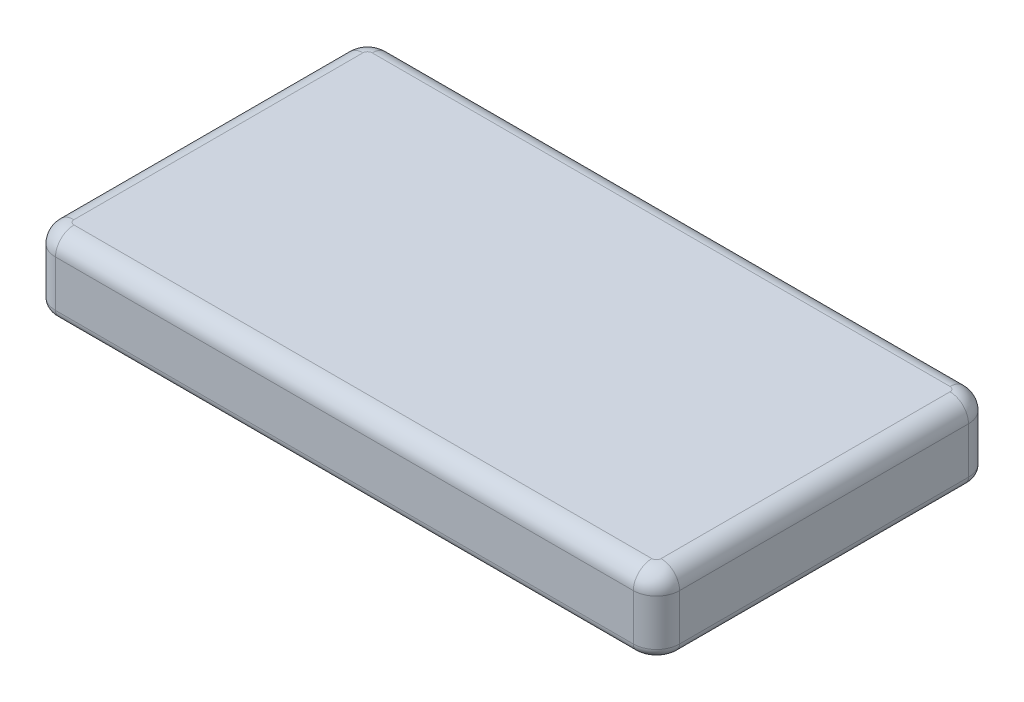
ISO-10303-21;
HEADER;
FILE_DESCRIPTION(('STEP AP214'),'2;1');
FILE_NAME('part.step','',(''),(''),'','','');
FILE_SCHEMA(('AUTOMOTIVE_DESIGN { 1 0 10303 214 1 1 1 1 }'));
ENDSEC;
DATA;
#1=APPLICATION_CONTEXT('core data for automotive mechanical design processes');
#2=APPLICATION_PROTOCOL_DEFINITION('international standard','automotive_design',2000,#1);
#3=PRODUCT_CONTEXT('',#1,'mechanical');
#4=PRODUCT('Part','Part','',(#3));
#5=PRODUCT_RELATED_PRODUCT_CATEGORY('part','',(#4));
#6=PRODUCT_DEFINITION_FORMATION('','',#4);
#7=PRODUCT_DEFINITION_CONTEXT('part definition',#1,'design');
#8=PRODUCT_DEFINITION('design','',#6,#7);
#9=PRODUCT_DEFINITION_SHAPE('','',#8);
#10=(LENGTH_UNIT() NAMED_UNIT(*) SI_UNIT(.MILLI.,.METRE.));
#11=(NAMED_UNIT(*) PLANE_ANGLE_UNIT() SI_UNIT($,.RADIAN.));
#12=(NAMED_UNIT(*) SI_UNIT($,.STERADIAN.) SOLID_ANGLE_UNIT());
#13=UNCERTAINTY_MEASURE_WITH_UNIT(LENGTH_MEASURE(1.E-05),#10,'distance_accuracy_value','');
#14=(GEOMETRIC_REPRESENTATION_CONTEXT(3) GLOBAL_UNCERTAINTY_ASSIGNED_CONTEXT((#13)) GLOBAL_UNIT_ASSIGNED_CONTEXT((#10,
#11,#12)) REPRESENTATION_CONTEXT('',''));
#15=CARTESIAN_POINT('',(0.,0.,0.));
#16=DIRECTION('',(0.,0.,1.));
#17=DIRECTION('',(1.,0.,0.));
#18=AXIS2_PLACEMENT_3D('',#15,#16,#17);
#19=CARTESIAN_POINT('',(135.,32.,72.5));
#20=DIRECTION('',(0.,1.,0.));
#21=DIRECTION('',(0.,0.,1.));
#22=AXIS2_PLACEMENT_3D('',#19,#20,#21);
#23=PLANE('',#22);
#24=CARTESIAN_POINT('',(125.,32.,62.5));
#25=DIRECTION('',(0.,1.,0.));
#26=DIRECTION('',(0.,0.,1.));
#27=AXIS2_PLACEMENT_3D('',#24,#25,#26);
#28=CIRCLE('',#27,2.);
#29=CARTESIAN_POINT('',(127.,32.,62.5));
#30=VERTEX_POINT('',#29);
#31=CARTESIAN_POINT('',(125.,32.,64.5));
#32=VERTEX_POINT('',#31);
#33=EDGE_CURVE('E259',#30,#32,#28,.F.);
#34=ORIENTED_EDGE('',*,*,#33,.F.);
#35=DIRECTION('',(0.,0.,-1.));
#36=VECTOR('',#35,1.);
#37=CARTESIAN_POINT('',(127.,32.,-72.5));
#38=LINE('',#37,#36);
#39=CARTESIAN_POINT('',(127.,32.,-62.5));
#40=VERTEX_POINT('',#39);
#41=EDGE_CURVE('E231',#30,#40,#38,.T.);
#42=ORIENTED_EDGE('',*,*,#41,.T.);
#43=CARTESIAN_POINT('',(125.,32.,-62.5));
#44=DIRECTION('',(0.,1.,0.));
#45=DIRECTION('',(0.,0.,1.));
#46=AXIS2_PLACEMENT_3D('',#43,#44,#45);
#47=CIRCLE('',#46,2.);
#48=CARTESIAN_POINT('',(125.,32.,-64.5));
#49=VERTEX_POINT('',#48);
#50=EDGE_CURVE('E256',#49,#40,#47,.F.);
#51=ORIENTED_EDGE('',*,*,#50,.F.);
#52=DIRECTION('',(-1.,0.,0.));
#53=VECTOR('',#52,1.);
#54=CARTESIAN_POINT('',(-135.,32.,-64.5));
#55=LINE('',#54,#53);
#56=CARTESIAN_POINT('',(-125.,32.,-64.5));
#57=VERTEX_POINT('',#56);
#58=EDGE_CURVE('E228',#49,#57,#55,.T.);
#59=ORIENTED_EDGE('',*,*,#58,.T.);
#60=CARTESIAN_POINT('',(-125.,32.,-62.5));
#61=DIRECTION('',(0.,1.,0.));
#62=DIRECTION('',(0.,0.,1.));
#63=AXIS2_PLACEMENT_3D('',#60,#61,#62);
#64=CIRCLE('',#63,2.);
#65=CARTESIAN_POINT('',(-127.,32.,-62.5));
#66=VERTEX_POINT('',#65);
#67=EDGE_CURVE('E251',#66,#57,#64,.F.);
#68=ORIENTED_EDGE('',*,*,#67,.F.);
#69=DIRECTION('',(0.,0.,1.));
#70=VECTOR('',#69,1.);
#71=CARTESIAN_POINT('',(-127.,32.,72.5));
#72=LINE('',#71,#70);
#73=CARTESIAN_POINT('',(-127.,32.,62.5));
#74=VERTEX_POINT('',#73);
#75=EDGE_CURVE('E224',#66,#74,#72,.T.);
#76=ORIENTED_EDGE('',*,*,#75,.T.);
#77=CARTESIAN_POINT('',(-125.,32.,62.5));
#78=DIRECTION('',(0.,1.,0.));
#79=DIRECTION('',(0.,0.,1.));
#80=AXIS2_PLACEMENT_3D('',#77,#78,#79);
#81=CIRCLE('',#80,2.);
#82=CARTESIAN_POINT('',(-125.,32.,64.5));
#83=VERTEX_POINT('',#82);
#84=EDGE_CURVE('E254',#83,#74,#81,.F.);
#85=ORIENTED_EDGE('',*,*,#84,.F.);
#86=DIRECTION('',(1.,0.,0.));
#87=VECTOR('',#86,1.);
#88=CARTESIAN_POINT('',(135.,32.,64.5));
#89=LINE('',#88,#87);
#90=EDGE_CURVE('E221',#83,#32,#89,.T.);
#91=ORIENTED_EDGE('',*,*,#90,.T.);
#92=EDGE_LOOP('',(#34,#42,#51,#59,#68,#76,#85,#91));
#93=FACE_BOUND('',#92,.T.);
#94=ADVANCED_FACE('F34',(#93),#23,.T.);
#95=CARTESIAN_POINT('',(135.,32.,-72.5));
#96=DIRECTION('',(-1.,0.,0.));
#97=DIRECTION('',(0.,0.,1.));
#98=AXIS2_PLACEMENT_3D('',#95,#96,#97);
#99=PLANE('',#98);
#100=DIRECTION('',(0.,-1.,0.));
#101=VECTOR('',#100,1.);
#102=CARTESIAN_POINT('',(135.,32.,62.5));
#103=LINE('',#102,#101);
#104=CARTESIAN_POINT('',(135.,24.,62.5));
#105=VERTEX_POINT('',#104);
#106=CARTESIAN_POINT('',(135.,4.,62.5));
#107=VERTEX_POINT('',#106);
#108=EDGE_CURVE('E288',#105,#107,#103,.T.);
#109=ORIENTED_EDGE('',*,*,#108,.T.);
#110=DIRECTION('',(0.,0.,-1.));
#111=VECTOR('',#110,1.);
#112=CARTESIAN_POINT('',(135.,4.,-72.5));
#113=LINE('',#112,#111);
#114=CARTESIAN_POINT('',(135.,4.,-62.5));
#115=VERTEX_POINT('',#114);
#116=EDGE_CURVE('E324',#107,#115,#113,.T.);
#117=ORIENTED_EDGE('',*,*,#116,.T.);
#118=DIRECTION('',(0.,-1.,0.));
#119=VECTOR('',#118,1.);
#120=CARTESIAN_POINT('',(135.,32.,-62.5));
#121=LINE('',#120,#119);
#122=CARTESIAN_POINT('',(135.,24.,-62.5));
#123=VERTEX_POINT('',#122);
#124=EDGE_CURVE('E291',#115,#123,#121,.F.);
#125=ORIENTED_EDGE('',*,*,#124,.T.);
#126=DIRECTION('',(0.,0.,-1.));
#127=VECTOR('',#126,1.);
#128=CARTESIAN_POINT('',(135.,24.,72.5));
#129=LINE('',#128,#127);
#130=EDGE_CURVE('E234',#123,#105,#129,.F.);
#131=ORIENTED_EDGE('',*,*,#130,.T.);
#132=EDGE_LOOP('',(#109,#117,#125,#131));
#133=FACE_BOUND('',#132,.T.);
#134=ADVANCED_FACE('F425',(#133),#99,.F.);
#135=CARTESIAN_POINT('',(-135.,32.,-72.5));
#136=DIRECTION('',(0.,0.,1.));
#137=DIRECTION('',(1.,0.,0.));
#138=AXIS2_PLACEMENT_3D('',#135,#136,#137);
#139=PLANE('',#138);
#140=DIRECTION('',(0.,-1.,0.));
#141=VECTOR('',#140,1.);
#142=CARTESIAN_POINT('',(125.,32.,-72.5));
#143=LINE('',#142,#141);
#144=CARTESIAN_POINT('',(125.,24.,-72.5));
#145=VERTEX_POINT('',#144);
#146=CARTESIAN_POINT('',(125.,4.,-72.5));
#147=VERTEX_POINT('',#146);
#148=EDGE_CURVE('E279',#145,#147,#143,.T.);
#149=ORIENTED_EDGE('',*,*,#148,.T.);
#150=DIRECTION('',(-1.,0.,0.));
#151=VECTOR('',#150,1.);
#152=CARTESIAN_POINT('',(-135.,4.,-72.5));
#153=LINE('',#152,#151);
#154=CARTESIAN_POINT('',(-125.,4.,-72.5));
#155=VERTEX_POINT('',#154);
#156=EDGE_CURVE('E11',#147,#155,#153,.T.);
#157=ORIENTED_EDGE('',*,*,#156,.T.);
#158=DIRECTION('',(0.,-1.,0.));
#159=VECTOR('',#158,1.);
#160=CARTESIAN_POINT('',(-125.,32.,-72.5));
#161=LINE('',#160,#159);
#162=CARTESIAN_POINT('',(-125.,24.,-72.5));
#163=VERTEX_POINT('',#162);
#164=EDGE_CURVE('E281',#155,#163,#161,.F.);
#165=ORIENTED_EDGE('',*,*,#164,.T.);
#166=DIRECTION('',(-1.,0.,0.));
#167=VECTOR('',#166,1.);
#168=CARTESIAN_POINT('',(135.,24.,-72.5));
#169=LINE('',#168,#167);
#170=EDGE_CURVE('E237',#163,#145,#169,.F.);
#171=ORIENTED_EDGE('',*,*,#170,.T.);
#172=EDGE_LOOP('',(#149,#157,#165,#171));
#173=FACE_BOUND('',#172,.T.);
#174=ADVANCED_FACE('F430',(#173),#139,.F.);
#175=CARTESIAN_POINT('',(-135.,32.,-72.5));
#176=DIRECTION('',(1.,0.,0.));
#177=DIRECTION('',(0.,0.,-1.));
#178=AXIS2_PLACEMENT_3D('',#175,#176,#177);
#179=PLANE('',#178);
#180=CARTESIAN_POINT('',(-135.,14.,48.2202590226989));
#181=DIRECTION('',(-1.,0.,0.));
#182=DIRECTION('',(0.,0.,1.));
#183=AXIS2_PLACEMENT_3D('',#180,#181,#182);
#184=CIRCLE('',#183,4.70742148390949);
#185=CARTESIAN_POINT('',(-135.,14.,52.9276805066084));
#186=VERTEX_POINT('',#185);
#187=EDGE_CURVE('E198',#186,#186,#184,.T.);
#188=ORIENTED_EDGE('',*,*,#187,.F.);
#189=EDGE_LOOP('',(#188));
#190=FACE_BOUND('',#189,.T.);
#191=DIRECTION('',(0.,0.,-1.));
#192=VECTOR('',#191,1.);
#193=CARTESIAN_POINT('',(-135.,18.040115952738,-11.5768889094162));
#194=LINE('',#193,#192);
#195=CARTESIAN_POINT('',(-135.,18.040115952738,11.5768889094163));
#196=VERTEX_POINT('',#195);
#197=CARTESIAN_POINT('',(-135.,18.040115952738,-11.5768889094162));
#198=VERTEX_POINT('',#197);
#199=EDGE_CURVE('E204',#196,#198,#194,.T.);
#200=ORIENTED_EDGE('',*,*,#199,.F.);
#201=DIRECTION('',(0.,1.,0.));
#202=VECTOR('',#201,1.);
#203=CARTESIAN_POINT('',(-135.,18.040115952738,11.5768889094163));
#204=LINE('',#203,#202);
#205=CARTESIAN_POINT('',(-135.,9.95988404726204,11.5768889094163));
#206=VERTEX_POINT('',#205);
#207=EDGE_CURVE('E51',#206,#196,#204,.T.);
#208=ORIENTED_EDGE('',*,*,#207,.F.);
#209=DIRECTION('',(0.,0.,1.));
#210=VECTOR('',#209,1.);
#211=CARTESIAN_POINT('',(-135.,9.95988404726204,-11.5768889094162));
#212=LINE('',#211,#210);
#213=CARTESIAN_POINT('',(-135.,9.95988404726204,-11.5768889094162));
#214=VERTEX_POINT('',#213);
#215=EDGE_CURVE('E192',#214,#206,#212,.T.);
#216=ORIENTED_EDGE('',*,*,#215,.F.);
#217=DIRECTION('',(0.,-1.,0.));
#218=VECTOR('',#217,1.);
#219=CARTESIAN_POINT('',(-135.,18.040115952738,-11.5768889094162));
#220=LINE('',#219,#218);
#221=EDGE_CURVE('E195',#198,#214,#220,.T.);
#222=ORIENTED_EDGE('',*,*,#221,.F.);
#223=EDGE_LOOP('',(#200,#208,#216,#222));
#224=FACE_BOUND('',#223,.T.);
#225=CARTESIAN_POINT('',(-135.,14.,-45.2002010463294));
#226=DIRECTION('',(-1.,0.,0.));
#227=DIRECTION('',(0.,0.,1.));
#228=AXIS2_PLACEMENT_3D('',#225,#226,#227);
#229=CIRCLE('',#228,3.52196255597082);
#230=CARTESIAN_POINT('',(-135.,14.,-41.6782384903585));
#231=VERTEX_POINT('',#230);
#232=EDGE_CURVE('E211',#231,#231,#229,.T.);
#233=ORIENTED_EDGE('',*,*,#232,.F.);
#234=EDGE_LOOP('',(#233));
#235=FACE_BOUND('',#234,.T.);
#236=DIRECTION('',(0.,-1.,0.));
#237=VECTOR('',#236,1.);
#238=CARTESIAN_POINT('',(-135.,32.,-62.5));
#239=LINE('',#238,#237);
#240=CARTESIAN_POINT('',(-135.,24.,-62.5));
#241=VERTEX_POINT('',#240);
#242=CARTESIAN_POINT('',(-135.,4.,-62.5));
#243=VERTEX_POINT('',#242);
#244=EDGE_CURVE('E276',#241,#243,#239,.T.);
#245=ORIENTED_EDGE('',*,*,#244,.T.);
#246=DIRECTION('',(0.,0.,1.));
#247=VECTOR('',#246,1.);
#248=CARTESIAN_POINT('',(-135.,4.,-72.5));
#249=LINE('',#248,#247);
#250=CARTESIAN_POINT('',(-135.,4.,62.5));
#251=VERTEX_POINT('',#250);
#252=EDGE_CURVE('E332',#243,#251,#249,.T.);
#253=ORIENTED_EDGE('',*,*,#252,.T.);
#254=DIRECTION('',(0.,-1.,0.));
#255=VECTOR('',#254,1.);
#256=CARTESIAN_POINT('',(-135.,32.,62.5));
#257=LINE('',#256,#255);
#258=CARTESIAN_POINT('',(-135.,24.,62.5));
#259=VERTEX_POINT('',#258);
#260=EDGE_CURVE('E274',#251,#259,#257,.F.);
#261=ORIENTED_EDGE('',*,*,#260,.T.);
#262=DIRECTION('',(0.,0.,1.));
#263=VECTOR('',#262,1.);
#264=CARTESIAN_POINT('',(-135.,24.,-72.5));
#265=LINE('',#264,#263);
#266=EDGE_CURVE('E240',#259,#241,#265,.F.);
#267=ORIENTED_EDGE('',*,*,#266,.T.);
#268=EDGE_LOOP('',(#245,#253,#261,#267));
#269=FACE_BOUND('',#268,.T.);
#270=ADVANCED_FACE('F443',(#190,#224,#235,#269),#179,.F.);
#271=CARTESIAN_POINT('',(-135.,32.,72.5));
#272=DIRECTION('',(0.,0.,-1.));
#273=DIRECTION('',(-1.,0.,0.));
#274=AXIS2_PLACEMENT_3D('',#271,#272,#273);
#275=PLANE('',#274);
#276=DIRECTION('',(0.,-1.,0.));
#277=VECTOR('',#276,1.);
#278=CARTESIAN_POINT('',(-125.,32.,72.5));
#279=LINE('',#278,#277);
#280=CARTESIAN_POINT('',(-125.,24.,72.5));
#281=VERTEX_POINT('',#280);
#282=CARTESIAN_POINT('',(-125.,4.,72.5));
#283=VERTEX_POINT('',#282);
#284=EDGE_CURVE('E285',#281,#283,#279,.T.);
#285=ORIENTED_EDGE('',*,*,#284,.T.);
#286=DIRECTION('',(1.,0.,0.));
#287=VECTOR('',#286,1.);
#288=CARTESIAN_POINT('',(-135.,4.,72.5));
#289=LINE('',#288,#287);
#290=CARTESIAN_POINT('',(125.,4.,72.5));
#291=VERTEX_POINT('',#290);
#292=EDGE_CURVE('E328',#283,#291,#289,.T.);
#293=ORIENTED_EDGE('',*,*,#292,.T.);
#294=DIRECTION('',(0.,-1.,0.));
#295=VECTOR('',#294,1.);
#296=CARTESIAN_POINT('',(125.,32.,72.5));
#297=LINE('',#296,#295);
#298=CARTESIAN_POINT('',(125.,24.,72.5));
#299=VERTEX_POINT('',#298);
#300=EDGE_CURVE('E283',#291,#299,#297,.F.);
#301=ORIENTED_EDGE('',*,*,#300,.T.);
#302=DIRECTION('',(1.,0.,0.));
#303=VECTOR('',#302,1.);
#304=CARTESIAN_POINT('',(-135.,24.,72.5));
#305=LINE('',#304,#303);
#306=EDGE_CURVE('E243',#299,#281,#305,.F.);
#307=ORIENTED_EDGE('',*,*,#306,.T.);
#308=EDGE_LOOP('',(#285,#293,#301,#307));
#309=FACE_BOUND('',#308,.T.);
#310=ADVANCED_FACE('F371',(#309),#275,.F.);
#311=CARTESIAN_POINT('',(135.,0.,72.5));
#312=DIRECTION('',(0.,1.,0.));
#313=DIRECTION('',(0.,0.,1.));
#314=AXIS2_PLACEMENT_3D('',#311,#312,#313);
#315=PLANE('',#314);
#316=DIRECTION('',(-1.,0.,0.));
#317=VECTOR('',#316,1.);
#318=CARTESIAN_POINT('',(135.,0.,-68.5));
#319=LINE('',#318,#317);
#320=CARTESIAN_POINT('',(-125.,0.,-68.5));
#321=VERTEX_POINT('',#320);
#322=CARTESIAN_POINT('',(125.,0.,-68.5));
#323=VERTEX_POINT('',#322);
#324=EDGE_CURVE('E293',#321,#323,#319,.F.);
#325=ORIENTED_EDGE('',*,*,#324,.T.);
#326=CARTESIAN_POINT('',(125.,0.,-62.5));
#327=DIRECTION('',(0.,1.,0.));
#328=DIRECTION('',(0.,0.,1.));
#329=AXIS2_PLACEMENT_3D('',#326,#327,#328);
#330=CIRCLE('',#329,6.);
#331=CARTESIAN_POINT('',(131.,0.,-62.5));
#332=VERTEX_POINT('',#331);
#333=EDGE_CURVE('E318',#323,#332,#330,.F.);
#334=ORIENTED_EDGE('',*,*,#333,.T.);
#335=DIRECTION('',(0.,0.,-1.));
#336=VECTOR('',#335,1.);
#337=CARTESIAN_POINT('',(131.,0.,72.5));
#338=LINE('',#337,#336);
#339=CARTESIAN_POINT('',(131.,0.,62.5));
#340=VERTEX_POINT('',#339);
#341=EDGE_CURVE('E316',#332,#340,#338,.F.);
#342=ORIENTED_EDGE('',*,*,#341,.T.);
#343=CARTESIAN_POINT('',(125.,0.,62.5));
#344=DIRECTION('',(0.,1.,0.));
#345=DIRECTION('',(0.,0.,1.));
#346=AXIS2_PLACEMENT_3D('',#343,#344,#345);
#347=CIRCLE('',#346,6.);
#348=CARTESIAN_POINT('',(125.,0.,68.5));
#349=VERTEX_POINT('',#348);
#350=EDGE_CURVE('E314',#340,#349,#347,.F.);
#351=ORIENTED_EDGE('',*,*,#350,.T.);
#352=DIRECTION('',(1.,0.,0.));
#353=VECTOR('',#352,1.);
#354=CARTESIAN_POINT('',(135.,0.,68.5));
#355=LINE('',#354,#353);
#356=CARTESIAN_POINT('',(-125.,0.,68.5));
#357=VERTEX_POINT('',#356);
#358=EDGE_CURVE('E312',#349,#357,#355,.F.);
#359=ORIENTED_EDGE('',*,*,#358,.T.);
#360=CARTESIAN_POINT('',(-125.,0.,62.5));
#361=DIRECTION('',(0.,1.,0.));
#362=DIRECTION('',(0.,0.,1.));
#363=AXIS2_PLACEMENT_3D('',#360,#361,#362);
#364=CIRCLE('',#363,6.);
#365=CARTESIAN_POINT('',(-131.,0.,62.5));
#366=VERTEX_POINT('',#365);
#367=EDGE_CURVE('E310',#357,#366,#364,.F.);
#368=ORIENTED_EDGE('',*,*,#367,.T.);
#369=DIRECTION('',(0.,0.,1.));
#370=VECTOR('',#369,1.);
#371=CARTESIAN_POINT('',(-131.,0.,72.5000000000001));
#372=LINE('',#371,#370);
#373=CARTESIAN_POINT('',(-131.,0.,-62.5));
#374=VERTEX_POINT('',#373);
#375=EDGE_CURVE('E308',#366,#374,#372,.F.);
#376=ORIENTED_EDGE('',*,*,#375,.T.);
#377=CARTESIAN_POINT('',(-125.,0.,-62.5));
#378=DIRECTION('',(0.,1.,0.));
#379=DIRECTION('',(0.,0.,1.));
#380=AXIS2_PLACEMENT_3D('',#377,#378,#379);
#381=CIRCLE('',#380,6.);
#382=EDGE_CURVE('E306',#374,#321,#381,.F.);
#383=ORIENTED_EDGE('',*,*,#382,.T.);
#384=EDGE_LOOP('',(#325,#334,#342,#351,#359,#368,#376,#383));
#385=FACE_BOUND('',#384,.T.);
#386=ADVANCED_FACE('F437',(#385),#315,.F.);
#387=CARTESIAN_POINT('',(-127.,24.,72.5000000000001));
#388=DIRECTION('',(0.,0.,-1.));
#389=DIRECTION('',(-1.,0.,0.));
#390=AXIS2_PLACEMENT_3D('',#387,#388,#389);
#391=CYLINDRICAL_SURFACE('',#390,8.);
#392=ORIENTED_EDGE('',*,*,#266,.F.);
#393=CARTESIAN_POINT('',(-127.,24.,62.5));
#394=DIRECTION('',(0.,0.,-1.));
#395=DIRECTION('',(-1.,0.,0.));
#396=AXIS2_PLACEMENT_3D('',#393,#394,#395);
#397=CIRCLE('',#396,8.);
#398=EDGE_CURVE('E267',#259,#74,#397,.T.);
#399=ORIENTED_EDGE('',*,*,#398,.T.);
#400=ORIENTED_EDGE('',*,*,#75,.F.);
#401=CARTESIAN_POINT('',(-127.,24.,-62.5));
#402=DIRECTION('',(0.,0.,1.));
#403=DIRECTION('',(1.,0.,0.));
#404=AXIS2_PLACEMENT_3D('',#401,#402,#403);
#405=CIRCLE('',#404,8.);
#406=EDGE_CURVE('E265',#66,#241,#405,.T.);
#407=ORIENTED_EDGE('',*,*,#406,.T.);
#408=EDGE_LOOP('',(#392,#399,#400,#407));
#409=FACE_BOUND('',#408,.T.);
#410=ADVANCED_FACE('F409',(#409),#391,.T.);
#411=CARTESIAN_POINT('',(135.,24.,64.5));
#412=DIRECTION('',(-1.,0.,0.));
#413=DIRECTION('',(0.,0.,1.));
#414=AXIS2_PLACEMENT_3D('',#411,#412,#413);
#415=CYLINDRICAL_SURFACE('',#414,8.);
#416=ORIENTED_EDGE('',*,*,#306,.F.);
#417=CARTESIAN_POINT('',(125.,24.,64.5));
#418=DIRECTION('',(-1.,0.,0.));
#419=DIRECTION('',(0.,0.,1.));
#420=AXIS2_PLACEMENT_3D('',#417,#418,#419);
#421=CIRCLE('',#420,8.);
#422=EDGE_CURVE('E248',#299,#32,#421,.T.);
#423=ORIENTED_EDGE('',*,*,#422,.T.);
#424=ORIENTED_EDGE('',*,*,#90,.F.);
#425=CARTESIAN_POINT('',(-125.,24.,64.5));
#426=DIRECTION('',(1.,0.,0.));
#427=DIRECTION('',(0.,0.,-1.));
#428=AXIS2_PLACEMENT_3D('',#425,#426,#427);
#429=CIRCLE('',#428,8.);
#430=EDGE_CURVE('E246',#83,#281,#429,.T.);
#431=ORIENTED_EDGE('',*,*,#430,.T.);
#432=EDGE_LOOP('',(#416,#423,#424,#431));
#433=FACE_BOUND('',#432,.T.);
#434=ADVANCED_FACE('F376',(#433),#415,.T.);
#435=CARTESIAN_POINT('',(135.,24.,-64.5));
#436=DIRECTION('',(1.,0.,0.));
#437=DIRECTION('',(0.,0.,-1.));
#438=AXIS2_PLACEMENT_3D('',#435,#436,#437);
#439=CYLINDRICAL_SURFACE('',#438,8.);
#440=ORIENTED_EDGE('',*,*,#170,.F.);
#441=CARTESIAN_POINT('',(-125.,24.,-64.5));
#442=DIRECTION('',(1.,0.,0.));
#443=DIRECTION('',(0.,0.,-1.));
#444=AXIS2_PLACEMENT_3D('',#441,#442,#443);
#445=CIRCLE('',#444,8.);
#446=EDGE_CURVE('E272',#163,#57,#445,.T.);
#447=ORIENTED_EDGE('',*,*,#446,.T.);
#448=ORIENTED_EDGE('',*,*,#58,.F.);
#449=CARTESIAN_POINT('',(125.,24.,-64.5));
#450=DIRECTION('',(-1.,0.,0.));
#451=DIRECTION('',(0.,0.,1.));
#452=AXIS2_PLACEMENT_3D('',#449,#450,#451);
#453=CIRCLE('',#452,8.);
#454=EDGE_CURVE('E270',#49,#145,#453,.T.);
#455=ORIENTED_EDGE('',*,*,#454,.T.);
#456=EDGE_LOOP('',(#440,#447,#448,#455));
#457=FACE_BOUND('',#456,.T.);
#458=ADVANCED_FACE('F401',(#457),#439,.T.);
#459=CARTESIAN_POINT('',(127.,24.,72.5));
#460=DIRECTION('',(0.,0.,1.));
#461=DIRECTION('',(1.,0.,0.));
#462=AXIS2_PLACEMENT_3D('',#459,#460,#461);
#463=CYLINDRICAL_SURFACE('',#462,8.);
#464=ORIENTED_EDGE('',*,*,#130,.F.);
#465=CARTESIAN_POINT('',(127.,24.,-62.5));
#466=DIRECTION('',(0.,0.,1.));
#467=DIRECTION('',(1.,0.,0.));
#468=AXIS2_PLACEMENT_3D('',#465,#466,#467);
#469=CIRCLE('',#468,8.);
#470=EDGE_CURVE('E263',#123,#40,#469,.T.);
#471=ORIENTED_EDGE('',*,*,#470,.T.);
#472=ORIENTED_EDGE('',*,*,#41,.F.);
#473=CARTESIAN_POINT('',(127.,24.,62.5));
#474=DIRECTION('',(0.,0.,-1.));
#475=DIRECTION('',(-1.,0.,0.));
#476=AXIS2_PLACEMENT_3D('',#473,#474,#475);
#477=CIRCLE('',#476,8.);
#478=EDGE_CURVE('E261',#30,#105,#477,.T.);
#479=ORIENTED_EDGE('',*,*,#478,.T.);
#480=EDGE_LOOP('',(#464,#471,#472,#479));
#481=FACE_BOUND('',#480,.T.);
#482=ADVANCED_FACE('F392',(#481),#463,.T.);
#483=CARTESIAN_POINT('',(125.,32.,62.5));
#484=DIRECTION('',(0.,-1.,0.));
#485=DIRECTION('',(0.,0.,-1.));
#486=AXIS2_PLACEMENT_3D('',#483,#484,#485);
#487=CYLINDRICAL_SURFACE('',#486,10.);
#488=ORIENTED_EDGE('',*,*,#300,.F.);
#489=CARTESIAN_POINT('',(125.,4.,62.5));
#490=DIRECTION('',(0.,1.,0.));
#491=DIRECTION('',(0.,0.,1.));
#492=AXIS2_PLACEMENT_3D('',#489,#490,#491);
#493=CIRCLE('',#492,10.);
#494=EDGE_CURVE('E326',#291,#107,#493,.T.);
#495=ORIENTED_EDGE('',*,*,#494,.T.);
#496=ORIENTED_EDGE('',*,*,#108,.F.);
#497=CARTESIAN_POINT('',(125.,24.,62.5));
#498=DIRECTION('',(0.,1.,0.));
#499=DIRECTION('',(0.,0.,1.));
#500=AXIS2_PLACEMENT_3D('',#497,#498,#499);
#501=CIRCLE('',#500,10.);
#502=EDGE_CURVE('E225',#299,#105,#501,.T.);
#503=ORIENTED_EDGE('',*,*,#502,.F.);
#504=EDGE_LOOP('',(#488,#495,#496,#503));
#505=FACE_BOUND('',#504,.T.);
#506=ADVANCED_FACE('F382',(#505),#487,.T.);
#507=CARTESIAN_POINT('',(125.,24.,62.5));
#508=DIRECTION('',(0.,1.,0.));
#509=DIRECTION('',(0.,0.,1.));
#510=AXIS2_PLACEMENT_3D('',#507,#508,#509);
#511=DEGENERATE_TOROIDAL_SURFACE('',#510,2.,8.,.T.);
#512=ORIENTED_EDGE('',*,*,#422,.F.);
#513=ORIENTED_EDGE('',*,*,#502,.T.);
#514=ORIENTED_EDGE('',*,*,#478,.F.);
#515=ORIENTED_EDGE('',*,*,#33,.T.);
#516=EDGE_LOOP('',(#512,#513,#514,#515));
#517=FACE_BOUND('',#516,.T.);
#518=ADVANCED_FACE('F386',(#517),#511,.T.);
#519=CARTESIAN_POINT('',(125.,32.,-62.5));
#520=DIRECTION('',(0.,-1.,0.));
#521=DIRECTION('',(0.,0.,-1.));
#522=AXIS2_PLACEMENT_3D('',#519,#520,#521);
#523=CYLINDRICAL_SURFACE('',#522,10.);
#524=ORIENTED_EDGE('',*,*,#124,.F.);
#525=CARTESIAN_POINT('',(125.,4.,-62.5));
#526=DIRECTION('',(0.,1.,0.));
#527=DIRECTION('',(0.,0.,1.));
#528=AXIS2_PLACEMENT_3D('',#525,#526,#527);
#529=CIRCLE('',#528,10.);
#530=EDGE_CURVE('E321',#115,#147,#529,.T.);
#531=ORIENTED_EDGE('',*,*,#530,.T.);
#532=ORIENTED_EDGE('',*,*,#148,.F.);
#533=CARTESIAN_POINT('',(125.,24.,-62.5));
#534=DIRECTION('',(0.,1.,0.));
#535=DIRECTION('',(0.,0.,1.));
#536=AXIS2_PLACEMENT_3D('',#533,#534,#535);
#537=CIRCLE('',#536,10.);
#538=EDGE_CURVE('E296',#123,#145,#537,.T.);
#539=ORIENTED_EDGE('',*,*,#538,.F.);
#540=EDGE_LOOP('',(#524,#531,#532,#539));
#541=FACE_BOUND('',#540,.T.);
#542=ADVANCED_FACE('F459',(#541),#523,.T.);
#543=CARTESIAN_POINT('',(125.,24.,-62.5));
#544=DIRECTION('',(0.,1.,0.));
#545=DIRECTION('',(0.,0.,1.));
#546=AXIS2_PLACEMENT_3D('',#543,#544,#545);
#547=DEGENERATE_TOROIDAL_SURFACE('',#546,2.,8.,.T.);
#548=ORIENTED_EDGE('',*,*,#454,.F.);
#549=ORIENTED_EDGE('',*,*,#50,.T.);
#550=ORIENTED_EDGE('',*,*,#470,.F.);
#551=ORIENTED_EDGE('',*,*,#538,.T.);
#552=EDGE_LOOP('',(#548,#549,#550,#551));
#553=FACE_BOUND('',#552,.T.);
#554=ADVANCED_FACE('F396',(#553),#547,.T.);
#555=CARTESIAN_POINT('',(-125.,32.,62.5));
#556=DIRECTION('',(0.,-1.,0.));
#557=DIRECTION('',(0.,0.,-1.));
#558=AXIS2_PLACEMENT_3D('',#555,#556,#557);
#559=CYLINDRICAL_SURFACE('',#558,10.);
#560=ORIENTED_EDGE('',*,*,#260,.F.);
#561=CARTESIAN_POINT('',(-125.,4.,62.5));
#562=DIRECTION('',(0.,1.,0.));
#563=DIRECTION('',(0.,0.,1.));
#564=AXIS2_PLACEMENT_3D('',#561,#562,#563);
#565=CIRCLE('',#564,10.);
#566=EDGE_CURVE('E330',#251,#283,#565,.T.);
#567=ORIENTED_EDGE('',*,*,#566,.T.);
#568=ORIENTED_EDGE('',*,*,#284,.F.);
#569=CARTESIAN_POINT('',(-125.,24.,62.5));
#570=DIRECTION('',(0.,1.,0.));
#571=DIRECTION('',(0.,0.,1.));
#572=AXIS2_PLACEMENT_3D('',#569,#570,#571);
#573=CIRCLE('',#572,10.);
#574=EDGE_CURVE('E299',#259,#281,#573,.T.);
#575=ORIENTED_EDGE('',*,*,#574,.F.);
#576=EDGE_LOOP('',(#560,#567,#568,#575));
#577=FACE_BOUND('',#576,.T.);
#578=ADVANCED_FACE('F368',(#577),#559,.T.);
#579=CARTESIAN_POINT('',(-125.,24.,62.5));
#580=DIRECTION('',(0.,1.,0.));
#581=DIRECTION('',(0.,0.,1.));
#582=AXIS2_PLACEMENT_3D('',#579,#580,#581);
#583=DEGENERATE_TOROIDAL_SURFACE('',#582,2.,8.,.T.);
#584=ORIENTED_EDGE('',*,*,#398,.F.);
#585=ORIENTED_EDGE('',*,*,#574,.T.);
#586=ORIENTED_EDGE('',*,*,#430,.F.);
#587=ORIENTED_EDGE('',*,*,#84,.T.);
#588=EDGE_LOOP('',(#584,#585,#586,#587));
#589=FACE_BOUND('',#588,.T.);
#590=ADVANCED_FACE('F412',(#589),#583,.T.);
#591=CARTESIAN_POINT('',(-125.,32.,-62.5));
#592=DIRECTION('',(0.,-1.,0.));
#593=DIRECTION('',(0.,0.,-1.));
#594=AXIS2_PLACEMENT_3D('',#591,#592,#593);
#595=CYLINDRICAL_SURFACE('',#594,10.);
#596=ORIENTED_EDGE('',*,*,#164,.F.);
#597=CARTESIAN_POINT('',(-125.,4.,-62.5));
#598=DIRECTION('',(0.,1.,0.));
#599=DIRECTION('',(0.,0.,1.));
#600=AXIS2_PLACEMENT_3D('',#597,#598,#599);
#601=CIRCLE('',#600,10.);
#602=EDGE_CURVE('E43',#155,#243,#601,.T.);
#603=ORIENTED_EDGE('',*,*,#602,.T.);
#604=ORIENTED_EDGE('',*,*,#244,.F.);
#605=CARTESIAN_POINT('',(-125.,24.,-62.5));
#606=DIRECTION('',(0.,1.,0.));
#607=DIRECTION('',(0.,0.,1.));
#608=AXIS2_PLACEMENT_3D('',#605,#606,#607);
#609=CIRCLE('',#608,10.);
#610=EDGE_CURVE('E302',#163,#241,#609,.T.);
#611=ORIENTED_EDGE('',*,*,#610,.F.);
#612=EDGE_LOOP('',(#596,#603,#604,#611));
#613=FACE_BOUND('',#612,.T.);
#614=ADVANCED_FACE('F414',(#613),#595,.T.);
#615=CARTESIAN_POINT('',(-125.,24.,-62.5));
#616=DIRECTION('',(0.,1.,0.));
#617=DIRECTION('',(0.,0.,1.));
#618=AXIS2_PLACEMENT_3D('',#615,#616,#617);
#619=DEGENERATE_TOROIDAL_SURFACE('',#618,2.,8.,.T.);
#620=ORIENTED_EDGE('',*,*,#406,.F.);
#621=ORIENTED_EDGE('',*,*,#67,.T.);
#622=ORIENTED_EDGE('',*,*,#446,.F.);
#623=ORIENTED_EDGE('',*,*,#610,.T.);
#624=EDGE_LOOP('',(#620,#621,#622,#623));
#625=FACE_BOUND('',#624,.T.);
#626=ADVANCED_FACE('F405',(#625),#619,.T.);
#627=CARTESIAN_POINT('',(-125.,4.,62.5));
#628=DIRECTION('',(0.,1.,0.));
#629=DIRECTION('',(0.,0.,1.));
#630=AXIS2_PLACEMENT_3D('',#627,#628,#629);
#631=TOROIDAL_SURFACE('',#630,6.,4.);
#632=CARTESIAN_POINT('',(-125.,4.,68.5));
#633=DIRECTION('',(1.,0.,0.));
#634=DIRECTION('',(0.,0.,-1.));
#635=AXIS2_PLACEMENT_3D('',#632,#633,#634);
#636=CIRCLE('',#635,4.);
#637=EDGE_CURVE('E349',#283,#357,#636,.T.);
#638=ORIENTED_EDGE('',*,*,#637,.F.);
#639=ORIENTED_EDGE('',*,*,#566,.F.);
#640=CARTESIAN_POINT('',(-131.,4.,62.5));
#641=DIRECTION('',(0.,0.,-1.));
#642=DIRECTION('',(-1.,0.,0.));
#643=AXIS2_PLACEMENT_3D('',#640,#641,#642);
#644=CIRCLE('',#643,4.);
#645=EDGE_CURVE('E38',#366,#251,#644,.T.);
#646=ORIENTED_EDGE('',*,*,#645,.F.);
#647=ORIENTED_EDGE('',*,*,#367,.F.);
#648=EDGE_LOOP('',(#638,#639,#646,#647));
#649=FACE_BOUND('',#648,.T.);
#650=ADVANCED_FACE('F36',(#649),#631,.T.);
#651=CARTESIAN_POINT('',(-131.,4.,-72.5));
#652=DIRECTION('',(0.,0.,1.));
#653=DIRECTION('',(1.,0.,0.));
#654=AXIS2_PLACEMENT_3D('',#651,#652,#653);
#655=CYLINDRICAL_SURFACE('',#654,4.);
#656=ORIENTED_EDGE('',*,*,#645,.T.);
#657=ORIENTED_EDGE('',*,*,#252,.F.);
#658=CARTESIAN_POINT('',(-131.,4.,-62.5));
#659=DIRECTION('',(0.,0.,-1.));
#660=DIRECTION('',(-1.,0.,0.));
#661=AXIS2_PLACEMENT_3D('',#658,#659,#660);
#662=CIRCLE('',#661,4.);
#663=EDGE_CURVE('E347',#374,#243,#662,.T.);
#664=ORIENTED_EDGE('',*,*,#663,.F.);
#665=ORIENTED_EDGE('',*,*,#375,.F.);
#666=EDGE_LOOP('',(#656,#657,#664,#665));
#667=FACE_BOUND('',#666,.T.);
#668=ADVANCED_FACE('F360',(#667),#655,.T.);
#669=CARTESIAN_POINT('',(-135.,4.,68.5));
#670=DIRECTION('',(1.,0.,0.));
#671=DIRECTION('',(0.,0.,-1.));
#672=AXIS2_PLACEMENT_3D('',#669,#670,#671);
#673=CYLINDRICAL_SURFACE('',#672,4.);
#674=ORIENTED_EDGE('',*,*,#637,.T.);
#675=ORIENTED_EDGE('',*,*,#358,.F.);
#676=CARTESIAN_POINT('',(125.,4.,68.5));
#677=DIRECTION('',(1.,0.,0.));
#678=DIRECTION('',(0.,0.,-1.));
#679=AXIS2_PLACEMENT_3D('',#676,#677,#678);
#680=CIRCLE('',#679,4.);
#681=EDGE_CURVE('E344',#291,#349,#680,.T.);
#682=ORIENTED_EDGE('',*,*,#681,.F.);
#683=ORIENTED_EDGE('',*,*,#292,.F.);
#684=EDGE_LOOP('',(#674,#675,#682,#683));
#685=FACE_BOUND('',#684,.T.);
#686=ADVANCED_FACE('F493',(#685),#673,.T.);
#687=CARTESIAN_POINT('',(-125.,4.,-62.5));
#688=DIRECTION('',(0.,1.,0.));
#689=DIRECTION('',(0.,0.,1.));
#690=AXIS2_PLACEMENT_3D('',#687,#688,#689);
#691=TOROIDAL_SURFACE('',#690,6.,4.);
#692=ORIENTED_EDGE('',*,*,#663,.T.);
#693=ORIENTED_EDGE('',*,*,#602,.F.);
#694=CARTESIAN_POINT('',(-125.,4.,-68.5));
#695=DIRECTION('',(1.,0.,0.));
#696=DIRECTION('',(0.,0.,-1.));
#697=AXIS2_PLACEMENT_3D('',#694,#695,#696);
#698=CIRCLE('',#697,4.);
#699=EDGE_CURVE('E341',#321,#155,#698,.T.);
#700=ORIENTED_EDGE('',*,*,#699,.F.);
#701=ORIENTED_EDGE('',*,*,#382,.F.);
#702=EDGE_LOOP('',(#692,#693,#700,#701));
#703=FACE_BOUND('',#702,.T.);
#704=ADVANCED_FACE('F488',(#703),#691,.T.);
#705=CARTESIAN_POINT('',(125.,4.,62.5));
#706=DIRECTION('',(0.,1.,0.));
#707=DIRECTION('',(0.,0.,1.));
#708=AXIS2_PLACEMENT_3D('',#705,#706,#707);
#709=TOROIDAL_SURFACE('',#708,6.,4.);
#710=ORIENTED_EDGE('',*,*,#681,.T.);
#711=ORIENTED_EDGE('',*,*,#350,.F.);
#712=CARTESIAN_POINT('',(131.,4.,62.5));
#713=DIRECTION('',(0.,0.,-1.));
#714=DIRECTION('',(-1.,0.,0.));
#715=AXIS2_PLACEMENT_3D('',#712,#713,#714);
#716=CIRCLE('',#715,4.);
#717=EDGE_CURVE('E338',#107,#340,#716,.T.);
#718=ORIENTED_EDGE('',*,*,#717,.F.);
#719=ORIENTED_EDGE('',*,*,#494,.F.);
#720=EDGE_LOOP('',(#710,#711,#718,#719));
#721=FACE_BOUND('',#720,.T.);
#722=ADVANCED_FACE('F492',(#721),#709,.T.);
#723=CARTESIAN_POINT('',(-135.,4.,-68.5));
#724=DIRECTION('',(-1.,0.,0.));
#725=DIRECTION('',(0.,0.,1.));
#726=AXIS2_PLACEMENT_3D('',#723,#724,#725);
#727=CYLINDRICAL_SURFACE('',#726,4.);
#728=ORIENTED_EDGE('',*,*,#699,.T.);
#729=ORIENTED_EDGE('',*,*,#156,.F.);
#730=CARTESIAN_POINT('',(125.,4.,-68.5));
#731=DIRECTION('',(1.,0.,0.));
#732=DIRECTION('',(0.,0.,-1.));
#733=AXIS2_PLACEMENT_3D('',#730,#731,#732);
#734=CIRCLE('',#733,4.);
#735=EDGE_CURVE('E336',#323,#147,#734,.T.);
#736=ORIENTED_EDGE('',*,*,#735,.F.);
#737=ORIENTED_EDGE('',*,*,#324,.F.);
#738=EDGE_LOOP('',(#728,#729,#736,#737));
#739=FACE_BOUND('',#738,.T.);
#740=ADVANCED_FACE('F485',(#739),#727,.T.);
#741=CARTESIAN_POINT('',(131.,4.,-72.5));
#742=DIRECTION('',(0.,0.,-1.));
#743=DIRECTION('',(-1.,0.,0.));
#744=AXIS2_PLACEMENT_3D('',#741,#742,#743);
#745=CYLINDRICAL_SURFACE('',#744,4.);
#746=ORIENTED_EDGE('',*,*,#717,.T.);
#747=ORIENTED_EDGE('',*,*,#341,.F.);
#748=CARTESIAN_POINT('',(131.,4.,-62.5));
#749=DIRECTION('',(0.,0.,-1.));
#750=DIRECTION('',(-1.,0.,0.));
#751=AXIS2_PLACEMENT_3D('',#748,#749,#750);
#752=CIRCLE('',#751,4.);
#753=EDGE_CURVE('E218',#115,#332,#752,.T.);
#754=ORIENTED_EDGE('',*,*,#753,.F.);
#755=ORIENTED_EDGE('',*,*,#116,.F.);
#756=EDGE_LOOP('',(#746,#747,#754,#755));
#757=FACE_BOUND('',#756,.T.);
#758=ADVANCED_FACE('F478',(#757),#745,.T.);
#759=CARTESIAN_POINT('',(125.,4.,-62.5));
#760=DIRECTION('',(0.,1.,0.));
#761=DIRECTION('',(0.,0.,1.));
#762=AXIS2_PLACEMENT_3D('',#759,#760,#761);
#763=TOROIDAL_SURFACE('',#762,6.,4.);
#764=ORIENTED_EDGE('',*,*,#735,.T.);
#765=ORIENTED_EDGE('',*,*,#530,.F.);
#766=ORIENTED_EDGE('',*,*,#753,.T.);
#767=ORIENTED_EDGE('',*,*,#333,.F.);
#768=EDGE_LOOP('',(#764,#765,#766,#767));
#769=FACE_BOUND('',#768,.T.);
#770=ADVANCED_FACE('F472',(#769),#763,.T.);
#771=CARTESIAN_POINT('',(-102.,14.,-45.2002010463294));
#772=DIRECTION('',(-1.,0.,0.));
#773=DIRECTION('',(0.,0.,1.));
#774=AXIS2_PLACEMENT_3D('',#771,#772,#773);
#775=CYLINDRICAL_SURFACE('',#774,3.52196255597082);
#776=CARTESIAN_POINT('',(-102.,14.,-45.2002010463294));
#777=DIRECTION('',(-1.,0.,0.));
#778=DIRECTION('',(0.,0.,1.));
#779=AXIS2_PLACEMENT_3D('',#776,#777,#778);
#780=CIRCLE('',#779,3.52196255597082);
#781=CARTESIAN_POINT('',(-102.,14.,-41.6782384903585));
#782=VERTEX_POINT('',#781);
#783=EDGE_CURVE('E215',#782,#782,#780,.T.);
#784=ORIENTED_EDGE('',*,*,#783,.F.);
#785=EDGE_LOOP('',(#784));
#786=FACE_BOUND('',#785,.T.);
#787=ORIENTED_EDGE('',*,*,#232,.T.);
#788=EDGE_LOOP('',(#787));
#789=FACE_BOUND('',#788,.T.);
#790=ADVANCED_FACE('F435',(#786,#789),#775,.F.);
#791=CARTESIAN_POINT('',(-102.,14.,-45.2002010463294));
#792=DIRECTION('',(-1.,0.,0.));
#793=DIRECTION('',(0.,0.,1.));
#794=AXIS2_PLACEMENT_3D('',#791,#792,#793);
#795=PLANE('',#794);
#796=ORIENTED_EDGE('',*,*,#783,.T.);
#797=EDGE_LOOP('',(#796));
#798=FACE_BOUND('',#797,.T.);
#799=ADVANCED_FACE('F537',(#798),#795,.T.);
#800=CARTESIAN_POINT('',(-102.,18.040115952738,11.5768889094163));
#801=DIRECTION('',(0.,0.,1.));
#802=DIRECTION('',(1.,0.,0.));
#803=AXIS2_PLACEMENT_3D('',#800,#801,#802);
#804=PLANE('',#803);
#805=ORIENTED_EDGE('',*,*,#207,.T.);
#806=DIRECTION('',(-1.,0.,0.));
#807=VECTOR('',#806,1.);
#808=CARTESIAN_POINT('',(-102.,18.040115952738,11.5768889094163));
#809=LINE('',#808,#807);
#810=CARTESIAN_POINT('',(-102.,18.040115952738,11.5768889094163));
#811=VERTEX_POINT('',#810);
#812=EDGE_CURVE('E170',#811,#196,#809,.T.);
#813=ORIENTED_EDGE('',*,*,#812,.F.);
#814=DIRECTION('',(0.,1.,0.));
#815=VECTOR('',#814,1.);
#816=CARTESIAN_POINT('',(-102.,18.040115952738,11.5768889094163));
#817=LINE('',#816,#815);
#818=CARTESIAN_POINT('',(-102.,9.95988404726204,11.5768889094163));
#819=VERTEX_POINT('',#818);
#820=EDGE_CURVE('E174',#819,#811,#817,.T.);
#821=ORIENTED_EDGE('',*,*,#820,.F.);
#822=DIRECTION('',(-1.,0.,0.));
#823=VECTOR('',#822,1.);
#824=CARTESIAN_POINT('',(-102.,9.95988404726204,11.5768889094163));
#825=LINE('',#824,#823);
#826=EDGE_CURVE('E209',#819,#206,#825,.T.);
#827=ORIENTED_EDGE('',*,*,#826,.T.);
#828=EDGE_LOOP('',(#805,#813,#821,#827));
#829=FACE_BOUND('',#828,.T.);
#830=ADVANCED_FACE('F172',(#829),#804,.F.);
#831=CARTESIAN_POINT('',(-102.,9.95988404726204,-11.5768889094162));
#832=DIRECTION('',(0.,-1.,0.));
#833=DIRECTION('',(0.,0.,-1.));
#834=AXIS2_PLACEMENT_3D('',#831,#832,#833);
#835=PLANE('',#834);
#836=ORIENTED_EDGE('',*,*,#215,.T.);
#837=ORIENTED_EDGE('',*,*,#826,.F.);
#838=DIRECTION('',(0.,0.,1.));
#839=VECTOR('',#838,1.);
#840=CARTESIAN_POINT('',(-102.,9.95988404726204,-11.5768889094162));
#841=LINE('',#840,#839);
#842=CARTESIAN_POINT('',(-102.,9.95988404726204,-11.5768889094162));
#843=VERTEX_POINT('',#842);
#844=EDGE_CURVE('E180',#843,#819,#841,.T.);
#845=ORIENTED_EDGE('',*,*,#844,.F.);
#846=DIRECTION('',(-1.,0.,0.));
#847=VECTOR('',#846,1.);
#848=CARTESIAN_POINT('',(-102.,9.95988404726204,-11.5768889094162));
#849=LINE('',#848,#847);
#850=EDGE_CURVE('E212',#843,#214,#849,.T.);
#851=ORIENTED_EDGE('',*,*,#850,.T.);
#852=EDGE_LOOP('',(#836,#837,#845,#851));
#853=FACE_BOUND('',#852,.T.);
#854=ADVANCED_FACE('F550',(#853),#835,.F.);
#855=CARTESIAN_POINT('',(-102.,18.040115952738,-11.5768889094162));
#856=DIRECTION('',(0.,0.,-1.));
#857=DIRECTION('',(0.,1.,0.));
#858=AXIS2_PLACEMENT_3D('',#855,#856,#857);
#859=PLANE('',#858);
#860=ORIENTED_EDGE('',*,*,#221,.T.);
#861=ORIENTED_EDGE('',*,*,#850,.F.);
#862=DIRECTION('',(0.,-1.,0.));
#863=VECTOR('',#862,1.);
#864=CARTESIAN_POINT('',(-102.,18.040115952738,-11.5768889094162));
#865=LINE('',#864,#863);
#866=CARTESIAN_POINT('',(-102.,18.040115952738,-11.5768889094162));
#867=VERTEX_POINT('',#866);
#868=EDGE_CURVE('E188',#867,#843,#865,.T.);
#869=ORIENTED_EDGE('',*,*,#868,.F.);
#870=DIRECTION('',(-1.,0.,0.));
#871=VECTOR('',#870,1.);
#872=CARTESIAN_POINT('',(-102.,18.040115952738,-11.5768889094162));
#873=LINE('',#872,#871);
#874=EDGE_CURVE('E179',#867,#198,#873,.T.);
#875=ORIENTED_EDGE('',*,*,#874,.T.);
#876=EDGE_LOOP('',(#860,#861,#869,#875));
#877=FACE_BOUND('',#876,.T.);
#878=ADVANCED_FACE('F557',(#877),#859,.F.);
#879=CARTESIAN_POINT('',(-102.,18.040115952738,-11.5768889094162));
#880=DIRECTION('',(0.,1.,0.));
#881=DIRECTION('',(0.,0.,1.));
#882=AXIS2_PLACEMENT_3D('',#879,#880,#881);
#883=PLANE('',#882);
#884=ORIENTED_EDGE('',*,*,#199,.T.);
#885=ORIENTED_EDGE('',*,*,#874,.F.);
#886=DIRECTION('',(0.,0.,-1.));
#887=VECTOR('',#886,1.);
#888=CARTESIAN_POINT('',(-102.,18.040115952738,-11.5768889094162));
#889=LINE('',#888,#887);
#890=EDGE_CURVE('E183',#811,#867,#889,.T.);
#891=ORIENTED_EDGE('',*,*,#890,.F.);
#892=ORIENTED_EDGE('',*,*,#812,.T.);
#893=EDGE_LOOP('',(#884,#885,#891,#892));
#894=FACE_BOUND('',#893,.T.);
#895=ADVANCED_FACE('F184',(#894),#883,.F.);
#896=CARTESIAN_POINT('',(-102.,9.95988404726204,11.5768889094163));
#897=DIRECTION('',(-1.,0.,0.));
#898=DIRECTION('',(0.,0.,1.));
#899=AXIS2_PLACEMENT_3D('',#896,#897,#898);
#900=PLANE('',#899);
#901=ORIENTED_EDGE('',*,*,#820,.T.);
#902=ORIENTED_EDGE('',*,*,#890,.T.);
#903=ORIENTED_EDGE('',*,*,#868,.T.);
#904=ORIENTED_EDGE('',*,*,#844,.T.);
#905=EDGE_LOOP('',(#901,#902,#903,#904));
#906=FACE_BOUND('',#905,.T.);
#907=ADVANCED_FACE('F190',(#906),#900,.T.);
#908=CARTESIAN_POINT('',(-102.,14.,48.2202590226989));
#909=DIRECTION('',(-1.,0.,0.));
#910=DIRECTION('',(0.,0.,1.));
#911=AXIS2_PLACEMENT_3D('',#908,#909,#910);
#912=CYLINDRICAL_SURFACE('',#911,4.70742148390949);
#913=CARTESIAN_POINT('',(-102.,14.,48.2202590226989));
#914=DIRECTION('',(-1.,0.,0.));
#915=DIRECTION('',(0.,0.,1.));
#916=AXIS2_PLACEMENT_3D('',#913,#914,#915);
#917=CIRCLE('',#916,4.70742148390949);
#918=CARTESIAN_POINT('',(-102.,14.,52.9276805066084));
#919=VERTEX_POINT('',#918);
#920=EDGE_CURVE('E205',#919,#919,#917,.T.);
#921=ORIENTED_EDGE('',*,*,#920,.F.);
#922=EDGE_LOOP('',(#921));
#923=FACE_BOUND('',#922,.T.);
#924=ORIENTED_EDGE('',*,*,#187,.T.);
#925=EDGE_LOOP('',(#924));
#926=FACE_BOUND('',#925,.T.);
#927=ADVANCED_FACE('F578',(#923,#926),#912,.F.);
#928=CARTESIAN_POINT('',(-102.,14.,48.2202590226989));
#929=DIRECTION('',(-1.,0.,0.));
#930=DIRECTION('',(0.,0.,1.));
#931=AXIS2_PLACEMENT_3D('',#928,#929,#930);
#932=PLANE('',#931);
#933=ORIENTED_EDGE('',*,*,#920,.T.);
#934=EDGE_LOOP('',(#933));
#935=FACE_BOUND('',#934,.T.);
#936=ADVANCED_FACE('F585',(#935),#932,.T.);
#937=CLOSED_SHELL('',(#94,#134,#174,#270,#310,#386,#410,#434,#458,#482,#506,#518,#542,#554,#578,
#590,#614,#626,#650,#668,#686,#704,#722,#740,#758,#770,#790,#799,#830,#854,#878,#895,#907,#927,#936));
#938=MANIFOLD_SOLID_BREP('B2',#937);
#939=ADVANCED_BREP_SHAPE_REPRESENTATION('',(#18,#938),#14);
#940=SHAPE_DEFINITION_REPRESENTATION(#9,#939);
ENDSEC;
END-ISO-10303-21;
